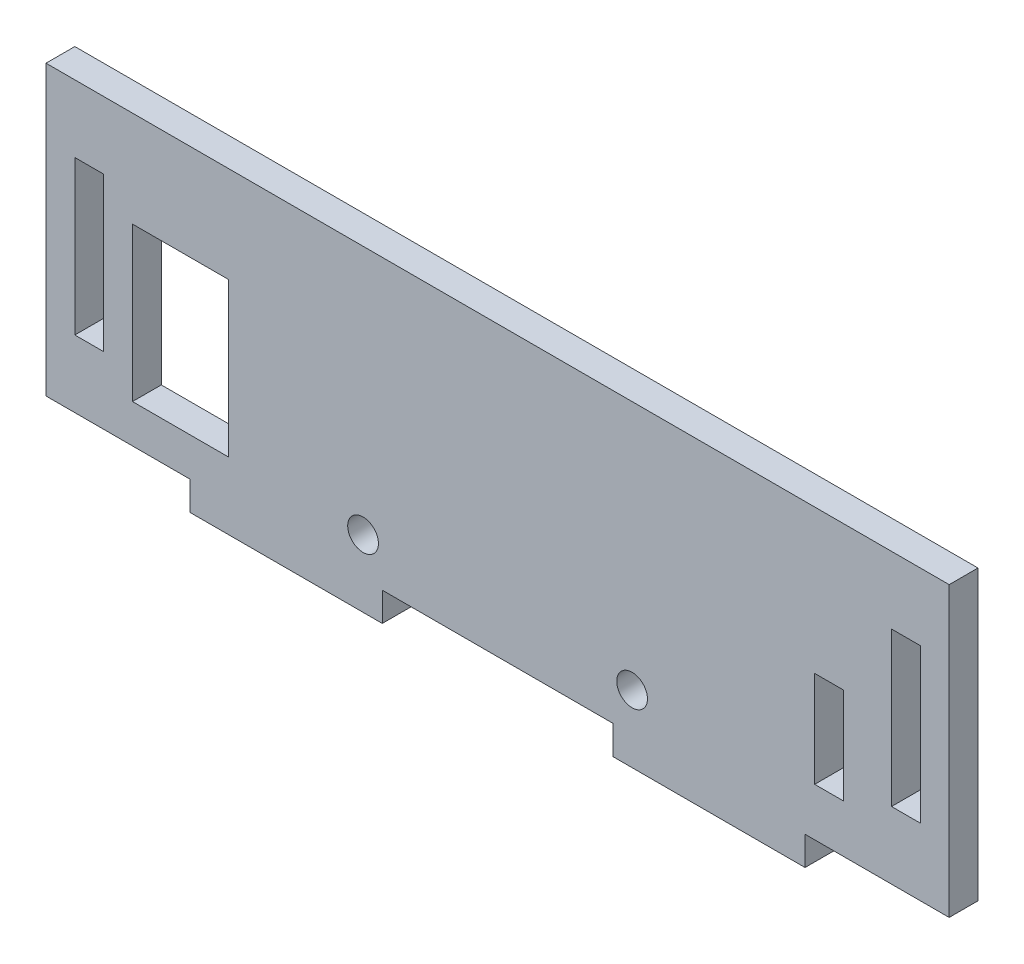
ISO-10303-21;
HEADER;
FILE_DESCRIPTION(('STEP AP214'),'2;1');
FILE_NAME('part.step','',(''),(''),'','','');
FILE_SCHEMA(('AUTOMOTIVE_DESIGN { 1 0 10303 214 1 1 1 1 }'));
ENDSEC;
DATA;
#1=APPLICATION_CONTEXT('core data for automotive mechanical design processes');
#2=APPLICATION_PROTOCOL_DEFINITION('international standard','automotive_design',2000,#1);
#3=PRODUCT_CONTEXT('',#1,'mechanical');
#4=PRODUCT('Part','Part','',(#3));
#5=PRODUCT_RELATED_PRODUCT_CATEGORY('part','',(#4));
#6=PRODUCT_DEFINITION_FORMATION('','',#4);
#7=PRODUCT_DEFINITION_CONTEXT('part definition',#1,'design');
#8=PRODUCT_DEFINITION('design','',#6,#7);
#9=PRODUCT_DEFINITION_SHAPE('','',#8);
#10=(LENGTH_UNIT() NAMED_UNIT(*) SI_UNIT(.MILLI.,.METRE.));
#11=(NAMED_UNIT(*) PLANE_ANGLE_UNIT() SI_UNIT($,.RADIAN.));
#12=(NAMED_UNIT(*) SI_UNIT($,.STERADIAN.) SOLID_ANGLE_UNIT());
#13=UNCERTAINTY_MEASURE_WITH_UNIT(LENGTH_MEASURE(1.E-05),#10,'distance_accuracy_value','');
#14=(GEOMETRIC_REPRESENTATION_CONTEXT(3) GLOBAL_UNCERTAINTY_ASSIGNED_CONTEXT((#13)) GLOBAL_UNIT_ASSIGNED_CONTEXT((#10,
#11,#12)) REPRESENTATION_CONTEXT('',''));
#15=CARTESIAN_POINT('',(0.,0.,0.));
#16=DIRECTION('',(0.,0.,1.));
#17=DIRECTION('',(1.,0.,0.));
#18=AXIS2_PLACEMENT_3D('',#15,#16,#17);
#19=CARTESIAN_POINT('',(0.,0.,3.));
#20=DIRECTION('',(-1.,0.,0.));
#21=DIRECTION('',(0.,0.,1.));
#22=AXIS2_PLACEMENT_3D('',#19,#20,#21);
#23=PLANE('',#22);
#24=DIRECTION('',(0.,1.,0.));
#25=VECTOR('',#24,1.);
#26=CARTESIAN_POINT('',(0.,0.,0.));
#27=LINE('',#26,#25);
#28=CARTESIAN_POINT('',(0.,7.,0.));
#29=VERTEX_POINT('',#28);
#30=CARTESIAN_POINT('',(0.,23.,0.));
#31=VERTEX_POINT('',#30);
#32=EDGE_CURVE('E329',#29,#31,#27,.T.);
#33=ORIENTED_EDGE('',*,*,#32,.T.);
#34=DIRECTION('',(0.,0.,-1.));
#35=VECTOR('',#34,1.);
#36=CARTESIAN_POINT('',(0.,23.,3.));
#37=LINE('',#36,#35);
#38=CARTESIAN_POINT('',(0.,23.,3.));
#39=VERTEX_POINT('',#38);
#40=EDGE_CURVE('E11',#39,#31,#37,.T.);
#41=ORIENTED_EDGE('',*,*,#40,.F.);
#42=DIRECTION('',(0.,1.,0.));
#43=VECTOR('',#42,1.);
#44=CARTESIAN_POINT('',(0.,0.,3.));
#45=LINE('',#44,#43);
#46=CARTESIAN_POINT('',(0.,7.,3.));
#47=VERTEX_POINT('',#46);
#48=EDGE_CURVE('E234',#47,#39,#45,.T.);
#49=ORIENTED_EDGE('',*,*,#48,.F.);
#50=DIRECTION('',(0.,0.,-1.));
#51=VECTOR('',#50,1.);
#52=CARTESIAN_POINT('',(0.,7.,3.));
#53=LINE('',#52,#51);
#54=EDGE_CURVE('E54',#47,#29,#53,.T.);
#55=ORIENTED_EDGE('',*,*,#54,.T.);
#56=EDGE_LOOP('',(#33,#41,#49,#55));
#57=FACE_BOUND('',#56,.T.);
#58=ADVANCED_FACE('F35',(#57),#23,.F.);
#59=CARTESIAN_POINT('',(0.,23.,3.));
#60=DIRECTION('',(0.,1.,0.));
#61=DIRECTION('',(0.,0.,1.));
#62=AXIS2_PLACEMENT_3D('',#59,#60,#61);
#63=PLANE('',#62);
#64=DIRECTION('',(1.,0.,0.));
#65=VECTOR('',#64,1.);
#66=CARTESIAN_POINT('',(0.,23.,0.));
#67=LINE('',#66,#65);
#68=CARTESIAN_POINT('',(3.,23.,0.));
#69=VERTEX_POINT('',#68);
#70=EDGE_CURVE('E240',#31,#69,#67,.T.);
#71=ORIENTED_EDGE('',*,*,#70,.T.);
#72=DIRECTION('',(0.,0.,-1.));
#73=VECTOR('',#72,1.);
#74=CARTESIAN_POINT('',(3.,23.,3.));
#75=LINE('',#74,#73);
#76=CARTESIAN_POINT('',(3.,23.,3.));
#77=VERTEX_POINT('',#76);
#78=EDGE_CURVE('E45',#77,#69,#75,.T.);
#79=ORIENTED_EDGE('',*,*,#78,.F.);
#80=DIRECTION('',(1.,0.,0.));
#81=VECTOR('',#80,1.);
#82=CARTESIAN_POINT('',(0.,23.,3.));
#83=LINE('',#82,#81);
#84=EDGE_CURVE('E228',#39,#77,#83,.T.);
#85=ORIENTED_EDGE('',*,*,#84,.F.);
#86=ORIENTED_EDGE('',*,*,#40,.T.);
#87=EDGE_LOOP('',(#71,#79,#85,#86));
#88=FACE_BOUND('',#87,.T.);
#89=ADVANCED_FACE('F239',(#88),#63,.F.);
#90=CARTESIAN_POINT('',(3.,0.,3.));
#91=DIRECTION('',(-1.,0.,0.));
#92=DIRECTION('',(0.,0.,1.));
#93=AXIS2_PLACEMENT_3D('',#90,#91,#92);
#94=PLANE('',#93);
#95=DIRECTION('',(0.,1.,0.));
#96=VECTOR('',#95,1.);
#97=CARTESIAN_POINT('',(3.,0.,0.));
#98=LINE('',#97,#96);
#99=CARTESIAN_POINT('',(3.,7.,0.));
#100=VERTEX_POINT('',#99);
#101=EDGE_CURVE('E332',#100,#69,#98,.T.);
#102=ORIENTED_EDGE('',*,*,#101,.F.);
#103=DIRECTION('',(0.,0.,-1.));
#104=VECTOR('',#103,1.);
#105=CARTESIAN_POINT('',(3.,7.,3.));
#106=LINE('',#105,#104);
#107=CARTESIAN_POINT('',(3.,7.,3.));
#108=VERTEX_POINT('',#107);
#109=EDGE_CURVE('E140',#108,#100,#106,.T.);
#110=ORIENTED_EDGE('',*,*,#109,.F.);
#111=DIRECTION('',(0.,1.,0.));
#112=VECTOR('',#111,1.);
#113=CARTESIAN_POINT('',(3.,0.,3.));
#114=LINE('',#113,#112);
#115=EDGE_CURVE('E233',#108,#77,#114,.T.);
#116=ORIENTED_EDGE('',*,*,#115,.T.);
#117=ORIENTED_EDGE('',*,*,#78,.T.);
#118=EDGE_LOOP('',(#102,#110,#116,#117));
#119=FACE_BOUND('',#118,.T.);
#120=ADVANCED_FACE('F244',(#119),#94,.T.);
#121=CARTESIAN_POINT('',(0.,4.,3.));
#122=DIRECTION('',(0.,1.,0.));
#123=DIRECTION('',(0.,0.,1.));
#124=AXIS2_PLACEMENT_3D('',#121,#122,#123);
#125=PLANE('',#124);
#126=DIRECTION('',(1.,0.,0.));
#127=VECTOR('',#126,1.);
#128=CARTESIAN_POINT('',(0.,4.,0.));
#129=LINE('',#128,#127);
#130=CARTESIAN_POINT('',(6.,4.,0.));
#131=VERTEX_POINT('',#130);
#132=CARTESIAN_POINT('',(16.,4.,0.));
#133=VERTEX_POINT('',#132);
#134=EDGE_CURVE('E314',#131,#133,#129,.T.);
#135=ORIENTED_EDGE('',*,*,#134,.F.);
#136=DIRECTION('',(0.,0.,-1.));
#137=VECTOR('',#136,1.);
#138=CARTESIAN_POINT('',(6.,4.,3.));
#139=LINE('',#138,#137);
#140=CARTESIAN_POINT('',(6.,4.,3.));
#141=VERTEX_POINT('',#140);
#142=EDGE_CURVE('E339',#141,#131,#139,.T.);
#143=ORIENTED_EDGE('',*,*,#142,.F.);
#144=DIRECTION('',(1.,0.,0.));
#145=VECTOR('',#144,1.);
#146=CARTESIAN_POINT('',(0.,4.,3.));
#147=LINE('',#146,#145);
#148=CARTESIAN_POINT('',(16.,4.,3.));
#149=VERTEX_POINT('',#148);
#150=EDGE_CURVE('E491',#141,#149,#147,.T.);
#151=ORIENTED_EDGE('',*,*,#150,.T.);
#152=DIRECTION('',(0.,0.,-1.));
#153=VECTOR('',#152,1.);
#154=CARTESIAN_POINT('',(16.,4.,3.));
#155=LINE('',#154,#153);
#156=EDGE_CURVE('E341',#149,#133,#155,.T.);
#157=ORIENTED_EDGE('',*,*,#156,.T.);
#158=EDGE_LOOP('',(#135,#143,#151,#157));
#159=FACE_BOUND('',#158,.T.);
#160=ADVANCED_FACE('F543',(#159),#125,.T.);
#161=CARTESIAN_POINT('',(6.,0.,3.));
#162=DIRECTION('',(-1.,0.,0.));
#163=DIRECTION('',(0.,0.,1.));
#164=AXIS2_PLACEMENT_3D('',#161,#162,#163);
#165=PLANE('',#164);
#166=DIRECTION('',(0.,1.,0.));
#167=VECTOR('',#166,1.);
#168=CARTESIAN_POINT('',(6.,0.,0.));
#169=LINE('',#168,#167);
#170=CARTESIAN_POINT('',(6.,20.,0.));
#171=VERTEX_POINT('',#170);
#172=EDGE_CURVE('E317',#131,#171,#169,.T.);
#173=ORIENTED_EDGE('',*,*,#172,.T.);
#174=DIRECTION('',(0.,0.,-1.));
#175=VECTOR('',#174,1.);
#176=CARTESIAN_POINT('',(6.,20.,3.));
#177=LINE('',#176,#175);
#178=CARTESIAN_POINT('',(6.,20.,3.));
#179=VERTEX_POINT('',#178);
#180=EDGE_CURVE('E346',#179,#171,#177,.T.);
#181=ORIENTED_EDGE('',*,*,#180,.F.);
#182=DIRECTION('',(0.,1.,0.));
#183=VECTOR('',#182,1.);
#184=CARTESIAN_POINT('',(6.,0.,3.));
#185=LINE('',#184,#183);
#186=EDGE_CURVE('E494',#141,#179,#185,.T.);
#187=ORIENTED_EDGE('',*,*,#186,.F.);
#188=ORIENTED_EDGE('',*,*,#142,.T.);
#189=EDGE_LOOP('',(#173,#181,#187,#188));
#190=FACE_BOUND('',#189,.T.);
#191=ADVANCED_FACE('F539',(#190),#165,.F.);
#192=CARTESIAN_POINT('',(0.,20.,3.));
#193=DIRECTION('',(0.,-1.,0.));
#194=DIRECTION('',(0.,0.,-1.));
#195=AXIS2_PLACEMENT_3D('',#192,#193,#194);
#196=PLANE('',#195);
#197=DIRECTION('',(-1.,0.,0.));
#198=VECTOR('',#197,1.);
#199=CARTESIAN_POINT('',(0.,20.,0.));
#200=LINE('',#199,#198);
#201=CARTESIAN_POINT('',(16.,20.,0.));
#202=VERTEX_POINT('',#201);
#203=EDGE_CURVE('E320',#202,#171,#200,.T.);
#204=ORIENTED_EDGE('',*,*,#203,.F.);
#205=DIRECTION('',(0.,0.,-1.));
#206=VECTOR('',#205,1.);
#207=CARTESIAN_POINT('',(16.,20.,3.));
#208=LINE('',#207,#206);
#209=CARTESIAN_POINT('',(16.,20.,3.));
#210=VERTEX_POINT('',#209);
#211=EDGE_CURVE('E343',#210,#202,#208,.T.);
#212=ORIENTED_EDGE('',*,*,#211,.F.);
#213=DIRECTION('',(-1.,0.,0.));
#214=VECTOR('',#213,1.);
#215=CARTESIAN_POINT('',(0.,20.,3.));
#216=LINE('',#215,#214);
#217=EDGE_CURVE('E496',#210,#179,#216,.T.);
#218=ORIENTED_EDGE('',*,*,#217,.T.);
#219=ORIENTED_EDGE('',*,*,#180,.T.);
#220=EDGE_LOOP('',(#204,#212,#218,#219));
#221=FACE_BOUND('',#220,.T.);
#222=ADVANCED_FACE('F535',(#221),#196,.T.);
#223=CARTESIAN_POINT('',(0.,23.,3.));
#224=DIRECTION('',(0.,-1.,0.));
#225=DIRECTION('',(0.,0.,-1.));
#226=AXIS2_PLACEMENT_3D('',#223,#224,#225);
#227=PLANE('',#226);
#228=DIRECTION('',(-1.,0.,0.));
#229=VECTOR('',#228,1.);
#230=CARTESIAN_POINT('',(0.,23.,0.));
#231=LINE('',#230,#229);
#232=CARTESIAN_POINT('',(88.,23.,0.));
#233=VERTEX_POINT('',#232);
#234=CARTESIAN_POINT('',(85.,23.,0.));
#235=VERTEX_POINT('',#234);
#236=EDGE_CURVE('E302',#233,#235,#231,.T.);
#237=ORIENTED_EDGE('',*,*,#236,.F.);
#238=DIRECTION('',(0.,0.,-1.));
#239=VECTOR('',#238,1.);
#240=CARTESIAN_POINT('',(88.,23.,3.));
#241=LINE('',#240,#239);
#242=CARTESIAN_POINT('',(88.,23.,3.));
#243=VERTEX_POINT('',#242);
#244=EDGE_CURVE('E344',#243,#233,#241,.T.);
#245=ORIENTED_EDGE('',*,*,#244,.F.);
#246=DIRECTION('',(-1.,0.,0.));
#247=VECTOR('',#246,1.);
#248=CARTESIAN_POINT('',(0.,23.,3.));
#249=LINE('',#248,#247);
#250=CARTESIAN_POINT('',(85.,23.,3.));
#251=VERTEX_POINT('',#250);
#252=EDGE_CURVE('E480',#243,#251,#249,.T.);
#253=ORIENTED_EDGE('',*,*,#252,.T.);
#254=DIRECTION('',(0.,0.,-1.));
#255=VECTOR('',#254,1.);
#256=CARTESIAN_POINT('',(85.,23.,3.));
#257=LINE('',#256,#255);
#258=EDGE_CURVE('E349',#251,#235,#257,.T.);
#259=ORIENTED_EDGE('',*,*,#258,.T.);
#260=EDGE_LOOP('',(#237,#245,#253,#259));
#261=FACE_BOUND('',#260,.T.);
#262=ADVANCED_FACE('F538',(#261),#227,.T.);
#263=CARTESIAN_POINT('',(88.,0.,3.));
#264=DIRECTION('',(-1.,0.,0.));
#265=DIRECTION('',(0.,0.,1.));
#266=AXIS2_PLACEMENT_3D('',#263,#264,#265);
#267=PLANE('',#266);
#268=DIRECTION('',(0.,1.,0.));
#269=VECTOR('',#268,1.);
#270=CARTESIAN_POINT('',(88.,0.,0.));
#271=LINE('',#270,#269);
#272=CARTESIAN_POINT('',(88.,7.,0.));
#273=VERTEX_POINT('',#272);
#274=EDGE_CURVE('E305',#273,#233,#271,.T.);
#275=ORIENTED_EDGE('',*,*,#274,.F.);
#276=DIRECTION('',(0.,0.,-1.));
#277=VECTOR('',#276,1.);
#278=CARTESIAN_POINT('',(88.,7.,3.));
#279=LINE('',#278,#277);
#280=CARTESIAN_POINT('',(88.,7.,3.));
#281=VERTEX_POINT('',#280);
#282=EDGE_CURVE('E354',#281,#273,#279,.T.);
#283=ORIENTED_EDGE('',*,*,#282,.F.);
#284=DIRECTION('',(0.,1.,0.));
#285=VECTOR('',#284,1.);
#286=CARTESIAN_POINT('',(88.,0.,3.));
#287=LINE('',#286,#285);
#288=EDGE_CURVE('E483',#281,#243,#287,.T.);
#289=ORIENTED_EDGE('',*,*,#288,.T.);
#290=ORIENTED_EDGE('',*,*,#244,.T.);
#291=EDGE_LOOP('',(#275,#283,#289,#290));
#292=FACE_BOUND('',#291,.T.);
#293=ADVANCED_FACE('F556',(#292),#267,.T.);
#294=CARTESIAN_POINT('',(0.,7.,3.));
#295=DIRECTION('',(0.,-1.,0.));
#296=DIRECTION('',(0.,0.,-1.));
#297=AXIS2_PLACEMENT_3D('',#294,#295,#296);
#298=PLANE('',#297);
#299=DIRECTION('',(-1.,0.,0.));
#300=VECTOR('',#299,1.);
#301=CARTESIAN_POINT('',(0.,7.,0.));
#302=LINE('',#301,#300);
#303=CARTESIAN_POINT('',(85.,7.,0.));
#304=VERTEX_POINT('',#303);
#305=EDGE_CURVE('E308',#273,#304,#302,.T.);
#306=ORIENTED_EDGE('',*,*,#305,.T.);
#307=DIRECTION('',(0.,0.,-1.));
#308=VECTOR('',#307,1.);
#309=CARTESIAN_POINT('',(85.,7.,3.));
#310=LINE('',#309,#308);
#311=CARTESIAN_POINT('',(85.,7.,3.));
#312=VERTEX_POINT('',#311);
#313=EDGE_CURVE('E351',#312,#304,#310,.T.);
#314=ORIENTED_EDGE('',*,*,#313,.F.);
#315=DIRECTION('',(-1.,0.,0.));
#316=VECTOR('',#315,1.);
#317=CARTESIAN_POINT('',(0.,7.,3.));
#318=LINE('',#317,#316);
#319=EDGE_CURVE('E486',#281,#312,#318,.T.);
#320=ORIENTED_EDGE('',*,*,#319,.F.);
#321=ORIENTED_EDGE('',*,*,#282,.T.);
#322=EDGE_LOOP('',(#306,#314,#320,#321));
#323=FACE_BOUND('',#322,.T.);
#324=ADVANCED_FACE('F552',(#323),#298,.F.);
#325=CARTESIAN_POINT('',(0.,15.,3.));
#326=DIRECTION('',(0.,-1.,0.));
#327=DIRECTION('',(0.,0.,-1.));
#328=AXIS2_PLACEMENT_3D('',#325,#326,#327);
#329=PLANE('',#328);
#330=DIRECTION('',(-1.,0.,0.));
#331=VECTOR('',#330,1.);
#332=CARTESIAN_POINT('',(0.,15.,0.));
#333=LINE('',#332,#331);
#334=CARTESIAN_POINT('',(80.,15.,0.));
#335=VERTEX_POINT('',#334);
#336=CARTESIAN_POINT('',(77.,15.,0.));
#337=VERTEX_POINT('',#336);
#338=EDGE_CURVE('E290',#335,#337,#333,.T.);
#339=ORIENTED_EDGE('',*,*,#338,.F.);
#340=DIRECTION('',(0.,0.,-1.));
#341=VECTOR('',#340,1.);
#342=CARTESIAN_POINT('',(80.,15.,3.));
#343=LINE('',#342,#341);
#344=CARTESIAN_POINT('',(80.,15.,3.));
#345=VERTEX_POINT('',#344);
#346=EDGE_CURVE('E352',#345,#335,#343,.T.);
#347=ORIENTED_EDGE('',*,*,#346,.F.);
#348=DIRECTION('',(-1.,0.,0.));
#349=VECTOR('',#348,1.);
#350=CARTESIAN_POINT('',(0.,15.,3.));
#351=LINE('',#350,#349);
#352=CARTESIAN_POINT('',(77.,15.,3.));
#353=VERTEX_POINT('',#352);
#354=EDGE_CURVE('E469',#345,#353,#351,.T.);
#355=ORIENTED_EDGE('',*,*,#354,.T.);
#356=DIRECTION('',(0.,0.,-1.));
#357=VECTOR('',#356,1.);
#358=CARTESIAN_POINT('',(77.,15.,3.));
#359=LINE('',#358,#357);
#360=EDGE_CURVE('E357',#353,#337,#359,.T.);
#361=ORIENTED_EDGE('',*,*,#360,.T.);
#362=EDGE_LOOP('',(#339,#347,#355,#361));
#363=FACE_BOUND('',#362,.T.);
#364=ADVANCED_FACE('F555',(#363),#329,.T.);
#365=CARTESIAN_POINT('',(80.,0.,3.));
#366=DIRECTION('',(1.,0.,0.));
#367=DIRECTION('',(0.,0.,-1.));
#368=AXIS2_PLACEMENT_3D('',#365,#366,#367);
#369=PLANE('',#368);
#370=DIRECTION('',(0.,-1.,0.));
#371=VECTOR('',#370,1.);
#372=CARTESIAN_POINT('',(80.,0.,0.));
#373=LINE('',#372,#371);
#374=CARTESIAN_POINT('',(80.,5.,0.));
#375=VERTEX_POINT('',#374);
#376=EDGE_CURVE('E293',#335,#375,#373,.T.);
#377=ORIENTED_EDGE('',*,*,#376,.T.);
#378=DIRECTION('',(0.,0.,-1.));
#379=VECTOR('',#378,1.);
#380=CARTESIAN_POINT('',(80.,5.,3.));
#381=LINE('',#380,#379);
#382=CARTESIAN_POINT('',(80.,5.,3.));
#383=VERTEX_POINT('',#382);
#384=EDGE_CURVE('E361',#383,#375,#381,.T.);
#385=ORIENTED_EDGE('',*,*,#384,.F.);
#386=DIRECTION('',(0.,-1.,0.));
#387=VECTOR('',#386,1.);
#388=CARTESIAN_POINT('',(80.,0.,3.));
#389=LINE('',#388,#387);
#390=EDGE_CURVE('E472',#345,#383,#389,.T.);
#391=ORIENTED_EDGE('',*,*,#390,.F.);
#392=ORIENTED_EDGE('',*,*,#346,.T.);
#393=EDGE_LOOP('',(#377,#385,#391,#392));
#394=FACE_BOUND('',#393,.T.);
#395=ADVANCED_FACE('F570',(#394),#369,.F.);
#396=CARTESIAN_POINT('',(0.,5.,3.));
#397=DIRECTION('',(0.,-1.,0.));
#398=DIRECTION('',(0.,0.,-1.));
#399=AXIS2_PLACEMENT_3D('',#396,#397,#398);
#400=PLANE('',#399);
#401=DIRECTION('',(-1.,0.,0.));
#402=VECTOR('',#401,1.);
#403=CARTESIAN_POINT('',(0.,5.,0.));
#404=LINE('',#403,#402);
#405=CARTESIAN_POINT('',(77.,5.,0.));
#406=VERTEX_POINT('',#405);
#407=EDGE_CURVE('E296',#375,#406,#404,.T.);
#408=ORIENTED_EDGE('',*,*,#407,.T.);
#409=DIRECTION('',(0.,0.,-1.));
#410=VECTOR('',#409,1.);
#411=CARTESIAN_POINT('',(77.,5.,3.));
#412=LINE('',#411,#410);
#413=CARTESIAN_POINT('',(77.,5.,3.));
#414=VERTEX_POINT('',#413);
#415=EDGE_CURVE('E359',#414,#406,#412,.T.);
#416=ORIENTED_EDGE('',*,*,#415,.F.);
#417=DIRECTION('',(-1.,0.,0.));
#418=VECTOR('',#417,1.);
#419=CARTESIAN_POINT('',(0.,5.,3.));
#420=LINE('',#419,#418);
#421=EDGE_CURVE('E475',#383,#414,#420,.T.);
#422=ORIENTED_EDGE('',*,*,#421,.F.);
#423=ORIENTED_EDGE('',*,*,#384,.T.);
#424=EDGE_LOOP('',(#408,#416,#422,#423));
#425=FACE_BOUND('',#424,.T.);
#426=ADVANCED_FACE('F567',(#425),#400,.F.);
#427=CARTESIAN_POINT('',(0.,30.,3.));
#428=DIRECTION('',(0.,1.,0.));
#429=DIRECTION('',(0.,0.,1.));
#430=AXIS2_PLACEMENT_3D('',#427,#428,#429);
#431=PLANE('',#430);
#432=DIRECTION('',(1.,0.,0.));
#433=VECTOR('',#432,1.);
#434=CARTESIAN_POINT('',(0.,30.,0.));
#435=LINE('',#434,#433);
#436=CARTESIAN_POINT('',(-3.,30.,0.));
#437=VERTEX_POINT('',#436);
#438=CARTESIAN_POINT('',(91.,30.,0.));
#439=VERTEX_POINT('',#438);
#440=EDGE_CURVE('E254',#437,#439,#435,.T.);
#441=ORIENTED_EDGE('',*,*,#440,.F.);
#442=DIRECTION('',(0.,0.,-1.));
#443=VECTOR('',#442,1.);
#444=CARTESIAN_POINT('',(-3.,30.,3.));
#445=LINE('',#444,#443);
#446=CARTESIAN_POINT('',(-3.,30.,3.));
#447=VERTEX_POINT('',#446);
#448=EDGE_CURVE('E39',#447,#437,#445,.T.);
#449=ORIENTED_EDGE('',*,*,#448,.F.);
#450=DIRECTION('',(1.,0.,0.));
#451=VECTOR('',#450,1.);
#452=CARTESIAN_POINT('',(0.,30.,3.));
#453=LINE('',#452,#451);
#454=CARTESIAN_POINT('',(91.,30.,3.));
#455=VERTEX_POINT('',#454);
#456=EDGE_CURVE('E402',#447,#455,#453,.T.);
#457=ORIENTED_EDGE('',*,*,#456,.T.);
#458=DIRECTION('',(0.,0.,-1.));
#459=VECTOR('',#458,1.);
#460=CARTESIAN_POINT('',(91.,30.,3.));
#461=LINE('',#460,#459);
#462=EDGE_CURVE('E247',#455,#439,#461,.T.);
#463=ORIENTED_EDGE('',*,*,#462,.T.);
#464=EDGE_LOOP('',(#441,#449,#457,#463));
#465=FACE_BOUND('',#464,.T.);
#466=ADVANCED_FACE('F401',(#465),#431,.T.);
#467=CARTESIAN_POINT('',(-3.,0.,3.));
#468=DIRECTION('',(1.,0.,0.));
#469=DIRECTION('',(0.,0.,-1.));
#470=AXIS2_PLACEMENT_3D('',#467,#468,#469);
#471=PLANE('',#470);
#472=DIRECTION('',(0.,-1.,0.));
#473=VECTOR('',#472,1.);
#474=CARTESIAN_POINT('',(-3.,0.,0.));
#475=LINE('',#474,#473);
#476=CARTESIAN_POINT('',(-3.,0.,0.));
#477=VERTEX_POINT('',#476);
#478=EDGE_CURVE('E257',#437,#477,#475,.T.);
#479=ORIENTED_EDGE('',*,*,#478,.T.);
#480=DIRECTION('',(0.,0.,-1.));
#481=VECTOR('',#480,1.);
#482=CARTESIAN_POINT('',(-3.,0.,3.));
#483=LINE('',#482,#481);
#484=CARTESIAN_POINT('',(-3.,0.,3.));
#485=VERTEX_POINT('',#484);
#486=EDGE_CURVE('E386',#485,#477,#483,.T.);
#487=ORIENTED_EDGE('',*,*,#486,.F.);
#488=DIRECTION('',(0.,-1.,0.));
#489=VECTOR('',#488,1.);
#490=CARTESIAN_POINT('',(-3.,0.,3.));
#491=LINE('',#490,#489);
#492=EDGE_CURVE('E394',#447,#485,#491,.T.);
#493=ORIENTED_EDGE('',*,*,#492,.F.);
#494=ORIENTED_EDGE('',*,*,#448,.T.);
#495=EDGE_LOOP('',(#479,#487,#493,#494));
#496=FACE_BOUND('',#495,.T.);
#497=ADVANCED_FACE('F393',(#496),#471,.F.);
#498=CARTESIAN_POINT('',(0.,0.,3.));
#499=DIRECTION('',(0.,-1.,0.));
#500=DIRECTION('',(0.,0.,-1.));
#501=AXIS2_PLACEMENT_3D('',#498,#499,#500);
#502=PLANE('',#501);
#503=DIRECTION('',(-1.,0.,0.));
#504=VECTOR('',#503,1.);
#505=CARTESIAN_POINT('',(0.,0.,0.));
#506=LINE('',#505,#504);
#507=CARTESIAN_POINT('',(12.,0.,0.));
#508=VERTEX_POINT('',#507);
#509=EDGE_CURVE('E260',#508,#477,#506,.T.);
#510=ORIENTED_EDGE('',*,*,#509,.F.);
#511=DIRECTION('',(0.,0.,-1.));
#512=VECTOR('',#511,1.);
#513=CARTESIAN_POINT('',(12.,0.,3.));
#514=LINE('',#513,#512);
#515=CARTESIAN_POINT('',(12.,0.,3.));
#516=VERTEX_POINT('',#515);
#517=EDGE_CURVE('E385',#516,#508,#514,.T.);
#518=ORIENTED_EDGE('',*,*,#517,.F.);
#519=DIRECTION('',(-1.,0.,0.));
#520=VECTOR('',#519,1.);
#521=CARTESIAN_POINT('',(0.,0.,3.));
#522=LINE('',#521,#520);
#523=EDGE_CURVE('E452',#516,#485,#522,.T.);
#524=ORIENTED_EDGE('',*,*,#523,.T.);
#525=ORIENTED_EDGE('',*,*,#486,.T.);
#526=EDGE_LOOP('',(#510,#518,#524,#525));
#527=FACE_BOUND('',#526,.T.);
#528=ADVANCED_FACE('F451',(#527),#502,.T.);
#529=CARTESIAN_POINT('',(12.,0.,3.));
#530=DIRECTION('',(1.,0.,0.));
#531=DIRECTION('',(0.,0.,-1.));
#532=AXIS2_PLACEMENT_3D('',#529,#530,#531);
#533=PLANE('',#532);
#534=DIRECTION('',(0.,-1.,0.));
#535=VECTOR('',#534,1.);
#536=CARTESIAN_POINT('',(12.,0.,0.));
#537=LINE('',#536,#535);
#538=CARTESIAN_POINT('',(12.,-3.,0.));
#539=VERTEX_POINT('',#538);
#540=EDGE_CURVE('E263',#508,#539,#537,.T.);
#541=ORIENTED_EDGE('',*,*,#540,.T.);
#542=DIRECTION('',(0.,0.,-1.));
#543=VECTOR('',#542,1.);
#544=CARTESIAN_POINT('',(12.,-3.,3.));
#545=LINE('',#544,#543);
#546=CARTESIAN_POINT('',(12.,-3.,3.));
#547=VERTEX_POINT('',#546);
#548=EDGE_CURVE('E382',#547,#539,#545,.T.);
#549=ORIENTED_EDGE('',*,*,#548,.F.);
#550=DIRECTION('',(0.,-1.,0.));
#551=VECTOR('',#550,1.);
#552=CARTESIAN_POINT('',(12.,0.,3.));
#553=LINE('',#552,#551);
#554=EDGE_CURVE('E449',#516,#547,#553,.T.);
#555=ORIENTED_EDGE('',*,*,#554,.F.);
#556=ORIENTED_EDGE('',*,*,#517,.T.);
#557=EDGE_LOOP('',(#541,#549,#555,#556));
#558=FACE_BOUND('',#557,.T.);
#559=ADVANCED_FACE('F448',(#558),#533,.F.);
#560=CARTESIAN_POINT('',(0.,-3.,3.));
#561=DIRECTION('',(0.,1.,0.));
#562=DIRECTION('',(0.,0.,1.));
#563=AXIS2_PLACEMENT_3D('',#560,#561,#562);
#564=PLANE('',#563);
#565=DIRECTION('',(1.,0.,0.));
#566=VECTOR('',#565,1.);
#567=CARTESIAN_POINT('',(0.,-3.,0.));
#568=LINE('',#567,#566);
#569=CARTESIAN_POINT('',(32.,-3.,0.));
#570=VERTEX_POINT('',#569);
#571=EDGE_CURVE('E266',#539,#570,#568,.T.);
#572=ORIENTED_EDGE('',*,*,#571,.T.);
#573=DIRECTION('',(0.,0.,-1.));
#574=VECTOR('',#573,1.);
#575=CARTESIAN_POINT('',(32.,-3.,3.));
#576=LINE('',#575,#574);
#577=CARTESIAN_POINT('',(32.,-3.,3.));
#578=VERTEX_POINT('',#577);
#579=EDGE_CURVE('E379',#578,#570,#576,.T.);
#580=ORIENTED_EDGE('',*,*,#579,.F.);
#581=DIRECTION('',(1.,0.,0.));
#582=VECTOR('',#581,1.);
#583=CARTESIAN_POINT('',(0.,-3.,3.));
#584=LINE('',#583,#582);
#585=EDGE_CURVE('E444',#547,#578,#584,.T.);
#586=ORIENTED_EDGE('',*,*,#585,.F.);
#587=ORIENTED_EDGE('',*,*,#548,.T.);
#588=EDGE_LOOP('',(#572,#580,#586,#587));
#589=FACE_BOUND('',#588,.T.);
#590=ADVANCED_FACE('F442',(#589),#564,.F.);
#591=CARTESIAN_POINT('',(32.,0.,3.));
#592=DIRECTION('',(-1.,0.,0.));
#593=DIRECTION('',(0.,0.,1.));
#594=AXIS2_PLACEMENT_3D('',#591,#592,#593);
#595=PLANE('',#594);
#596=DIRECTION('',(0.,1.,0.));
#597=VECTOR('',#596,1.);
#598=CARTESIAN_POINT('',(32.,0.,0.));
#599=LINE('',#598,#597);
#600=CARTESIAN_POINT('',(32.,0.,0.));
#601=VERTEX_POINT('',#600);
#602=EDGE_CURVE('E269',#570,#601,#599,.T.);
#603=ORIENTED_EDGE('',*,*,#602,.T.);
#604=DIRECTION('',(0.,0.,-1.));
#605=VECTOR('',#604,1.);
#606=CARTESIAN_POINT('',(32.,0.,3.));
#607=LINE('',#606,#605);
#608=CARTESIAN_POINT('',(32.,0.,3.));
#609=VERTEX_POINT('',#608);
#610=EDGE_CURVE('E376',#609,#601,#607,.T.);
#611=ORIENTED_EDGE('',*,*,#610,.F.);
#612=DIRECTION('',(0.,1.,0.));
#613=VECTOR('',#612,1.);
#614=CARTESIAN_POINT('',(32.,0.,3.));
#615=LINE('',#614,#613);
#616=EDGE_CURVE('E460',#578,#609,#615,.T.);
#617=ORIENTED_EDGE('',*,*,#616,.F.);
#618=ORIENTED_EDGE('',*,*,#579,.T.);
#619=EDGE_LOOP('',(#603,#611,#617,#618));
#620=FACE_BOUND('',#619,.T.);
#621=ADVANCED_FACE('F438',(#620),#595,.F.);
#622=CARTESIAN_POINT('',(0.,0.,3.));
#623=DIRECTION('',(0.,1.,0.));
#624=DIRECTION('',(0.,0.,1.));
#625=AXIS2_PLACEMENT_3D('',#622,#623,#624);
#626=PLANE('',#625);
#627=DIRECTION('',(1.,0.,0.));
#628=VECTOR('',#627,1.);
#629=CARTESIAN_POINT('',(0.,0.,0.));
#630=LINE('',#629,#628);
#631=CARTESIAN_POINT('',(56.,0.,0.));
#632=VERTEX_POINT('',#631);
#633=EDGE_CURVE('E272',#601,#632,#630,.T.);
#634=ORIENTED_EDGE('',*,*,#633,.T.);
#635=DIRECTION('',(0.,0.,-1.));
#636=VECTOR('',#635,1.);
#637=CARTESIAN_POINT('',(56.,0.,3.));
#638=LINE('',#637,#636);
#639=CARTESIAN_POINT('',(56.,0.,3.));
#640=VERTEX_POINT('',#639);
#641=EDGE_CURVE('E374',#640,#632,#638,.T.);
#642=ORIENTED_EDGE('',*,*,#641,.F.);
#643=DIRECTION('',(1.,0.,0.));
#644=VECTOR('',#643,1.);
#645=CARTESIAN_POINT('',(0.,0.,3.));
#646=LINE('',#645,#644);
#647=EDGE_CURVE('E435',#609,#640,#646,.T.);
#648=ORIENTED_EDGE('',*,*,#647,.F.);
#649=ORIENTED_EDGE('',*,*,#610,.T.);
#650=EDGE_LOOP('',(#634,#642,#648,#649));
#651=FACE_BOUND('',#650,.T.);
#652=ADVANCED_FACE('F433',(#651),#626,.F.);
#653=CARTESIAN_POINT('',(56.,0.,3.));
#654=DIRECTION('',(-1.,0.,0.));
#655=DIRECTION('',(0.,0.,1.));
#656=AXIS2_PLACEMENT_3D('',#653,#654,#655);
#657=PLANE('',#656);
#658=DIRECTION('',(0.,1.,0.));
#659=VECTOR('',#658,1.);
#660=CARTESIAN_POINT('',(56.,0.,0.));
#661=LINE('',#660,#659);
#662=CARTESIAN_POINT('',(56.,-3.,0.));
#663=VERTEX_POINT('',#662);
#664=EDGE_CURVE('E275',#663,#632,#661,.T.);
#665=ORIENTED_EDGE('',*,*,#664,.F.);
#666=DIRECTION('',(0.,0.,-1.));
#667=VECTOR('',#666,1.);
#668=CARTESIAN_POINT('',(56.,-3.,3.));
#669=LINE('',#668,#667);
#670=CARTESIAN_POINT('',(56.,-3.,3.));
#671=VERTEX_POINT('',#670);
#672=EDGE_CURVE('E372',#671,#663,#669,.T.);
#673=ORIENTED_EDGE('',*,*,#672,.F.);
#674=DIRECTION('',(0.,1.,0.));
#675=VECTOR('',#674,1.);
#676=CARTESIAN_POINT('',(56.,0.,3.));
#677=LINE('',#676,#675);
#678=EDGE_CURVE('E431',#671,#640,#677,.T.);
#679=ORIENTED_EDGE('',*,*,#678,.T.);
#680=ORIENTED_EDGE('',*,*,#641,.T.);
#681=EDGE_LOOP('',(#665,#673,#679,#680));
#682=FACE_BOUND('',#681,.T.);
#683=ADVANCED_FACE('F427',(#682),#657,.T.);
#684=CARTESIAN_POINT('',(0.,-3.00000000000001,3.));
#685=DIRECTION('',(0.,-1.,0.));
#686=DIRECTION('',(1.,0.,0.));
#687=AXIS2_PLACEMENT_3D('',#684,#685,#686);
#688=PLANE('',#687);
#689=DIRECTION('',(-1.,0.,0.));
#690=VECTOR('',#689,1.);
#691=CARTESIAN_POINT('',(0.,-3.00000000000001,0.));
#692=LINE('',#691,#690);
#693=CARTESIAN_POINT('',(76.,-3.,0.));
#694=VERTEX_POINT('',#693);
#695=EDGE_CURVE('E278',#694,#663,#692,.T.);
#696=ORIENTED_EDGE('',*,*,#695,.F.);
#697=DIRECTION('',(0.,0.,-1.));
#698=VECTOR('',#697,1.);
#699=CARTESIAN_POINT('',(76.,-3.,3.));
#700=LINE('',#699,#698);
#701=CARTESIAN_POINT('',(76.,-3.,3.));
#702=VERTEX_POINT('',#701);
#703=EDGE_CURVE('E370',#702,#694,#700,.T.);
#704=ORIENTED_EDGE('',*,*,#703,.F.);
#705=DIRECTION('',(-1.,0.,0.));
#706=VECTOR('',#705,1.);
#707=CARTESIAN_POINT('',(0.,-3.00000000000001,3.));
#708=LINE('',#707,#706);
#709=EDGE_CURVE('E464',#702,#671,#708,.T.);
#710=ORIENTED_EDGE('',*,*,#709,.T.);
#711=ORIENTED_EDGE('',*,*,#672,.T.);
#712=EDGE_LOOP('',(#696,#704,#710,#711));
#713=FACE_BOUND('',#712,.T.);
#714=ADVANCED_FACE('F424',(#713),#688,.T.);
#715=CARTESIAN_POINT('',(76.,0.,3.));
#716=DIRECTION('',(1.,0.,0.));
#717=DIRECTION('',(0.,0.,-1.));
#718=AXIS2_PLACEMENT_3D('',#715,#716,#717);
#719=PLANE('',#718);
#720=DIRECTION('',(0.,-1.,0.));
#721=VECTOR('',#720,1.);
#722=CARTESIAN_POINT('',(76.,0.,0.));
#723=LINE('',#722,#721);
#724=CARTESIAN_POINT('',(76.,0.,0.));
#725=VERTEX_POINT('',#724);
#726=EDGE_CURVE('E281',#725,#694,#723,.T.);
#727=ORIENTED_EDGE('',*,*,#726,.F.);
#728=DIRECTION('',(0.,0.,-1.));
#729=VECTOR('',#728,1.);
#730=CARTESIAN_POINT('',(76.,0.,3.));
#731=LINE('',#730,#729);
#732=CARTESIAN_POINT('',(76.,0.,3.));
#733=VERTEX_POINT('',#732);
#734=EDGE_CURVE('E368',#733,#725,#731,.T.);
#735=ORIENTED_EDGE('',*,*,#734,.F.);
#736=DIRECTION('',(0.,-1.,0.));
#737=VECTOR('',#736,1.);
#738=CARTESIAN_POINT('',(76.,0.,3.));
#739=LINE('',#738,#737);
#740=EDGE_CURVE('E420',#733,#702,#739,.T.);
#741=ORIENTED_EDGE('',*,*,#740,.T.);
#742=ORIENTED_EDGE('',*,*,#703,.T.);
#743=EDGE_LOOP('',(#727,#735,#741,#742));
#744=FACE_BOUND('',#743,.T.);
#745=ADVANCED_FACE('F418',(#744),#719,.T.);
#746=CARTESIAN_POINT('',(0.,0.,3.));
#747=DIRECTION('',(0.,-1.,0.));
#748=DIRECTION('',(0.,0.,-1.));
#749=AXIS2_PLACEMENT_3D('',#746,#747,#748);
#750=PLANE('',#749);
#751=DIRECTION('',(-1.,0.,0.));
#752=VECTOR('',#751,1.);
#753=CARTESIAN_POINT('',(0.,0.,0.));
#754=LINE('',#753,#752);
#755=CARTESIAN_POINT('',(91.,0.,0.));
#756=VERTEX_POINT('',#755);
#757=EDGE_CURVE('E284',#756,#725,#754,.T.);
#758=ORIENTED_EDGE('',*,*,#757,.F.);
#759=DIRECTION('',(0.,0.,-1.));
#760=VECTOR('',#759,1.);
#761=CARTESIAN_POINT('',(91.,0.,3.));
#762=LINE('',#761,#760);
#763=CARTESIAN_POINT('',(91.,0.,3.));
#764=VERTEX_POINT('',#763);
#765=EDGE_CURVE('E366',#764,#756,#762,.T.);
#766=ORIENTED_EDGE('',*,*,#765,.F.);
#767=DIRECTION('',(-1.,0.,0.));
#768=VECTOR('',#767,1.);
#769=CARTESIAN_POINT('',(0.,0.,3.));
#770=LINE('',#769,#768);
#771=EDGE_CURVE('E414',#764,#733,#770,.T.);
#772=ORIENTED_EDGE('',*,*,#771,.T.);
#773=ORIENTED_EDGE('',*,*,#734,.T.);
#774=EDGE_LOOP('',(#758,#766,#772,#773));
#775=FACE_BOUND('',#774,.T.);
#776=ADVANCED_FACE('F411',(#775),#750,.T.);
#777=CARTESIAN_POINT('',(30.,4.,3.));
#778=DIRECTION('',(0.,0.,-1.));
#779=DIRECTION('',(-1.,0.,0.));
#780=AXIS2_PLACEMENT_3D('',#777,#778,#779);
#781=CYLINDRICAL_SURFACE('',#780,1.6);
#782=CARTESIAN_POINT('',(30.,4.,3.));
#783=DIRECTION('',(0.,0.,1.));
#784=DIRECTION('',(1.,0.,0.));
#785=AXIS2_PLACEMENT_3D('',#782,#783,#784);
#786=CIRCLE('',#785,1.6);
#787=CARTESIAN_POINT('',(31.6,4.,3.));
#788=VERTEX_POINT('',#787);
#789=EDGE_CURVE('E501',#788,#788,#786,.T.);
#790=ORIENTED_EDGE('',*,*,#789,.T.);
#791=EDGE_LOOP('',(#790));
#792=FACE_BOUND('',#791,.T.);
#793=CARTESIAN_POINT('',(30.,4.,0.));
#794=DIRECTION('',(0.,0.,1.));
#795=DIRECTION('',(1.,0.,0.));
#796=AXIS2_PLACEMENT_3D('',#793,#794,#795);
#797=CIRCLE('',#796,1.6);
#798=CARTESIAN_POINT('',(31.6,4.,0.));
#799=VERTEX_POINT('',#798);
#800=EDGE_CURVE('E326',#799,#799,#797,.T.);
#801=ORIENTED_EDGE('',*,*,#800,.F.);
#802=EDGE_LOOP('',(#801));
#803=FACE_BOUND('',#802,.T.);
#804=ADVANCED_FACE('F505',(#792,#803),#781,.F.);
#805=CARTESIAN_POINT('',(16.,0.,3.));
#806=DIRECTION('',(1.,0.,0.));
#807=DIRECTION('',(0.,0.,-1.));
#808=AXIS2_PLACEMENT_3D('',#805,#806,#807);
#809=PLANE('',#808);
#810=DIRECTION('',(0.,-1.,0.));
#811=VECTOR('',#810,1.);
#812=CARTESIAN_POINT('',(16.,0.,0.));
#813=LINE('',#812,#811);
#814=EDGE_CURVE('E323',#202,#133,#813,.T.);
#815=ORIENTED_EDGE('',*,*,#814,.T.);
#816=ORIENTED_EDGE('',*,*,#156,.F.);
#817=DIRECTION('',(0.,-1.,0.));
#818=VECTOR('',#817,1.);
#819=CARTESIAN_POINT('',(16.,0.,3.));
#820=LINE('',#819,#818);
#821=EDGE_CURVE('E499',#210,#149,#820,.T.);
#822=ORIENTED_EDGE('',*,*,#821,.F.);
#823=ORIENTED_EDGE('',*,*,#211,.T.);
#824=EDGE_LOOP('',(#815,#816,#822,#823));
#825=FACE_BOUND('',#824,.T.);
#826=ADVANCED_FACE('F530',(#825),#809,.F.);
#827=CARTESIAN_POINT('',(85.,0.,3.));
#828=DIRECTION('',(1.,0.,0.));
#829=DIRECTION('',(0.,0.,-1.));
#830=AXIS2_PLACEMENT_3D('',#827,#828,#829);
#831=PLANE('',#830);
#832=DIRECTION('',(0.,-1.,0.));
#833=VECTOR('',#832,1.);
#834=CARTESIAN_POINT('',(85.,0.,0.));
#835=LINE('',#834,#833);
#836=EDGE_CURVE('E311',#235,#304,#835,.T.);
#837=ORIENTED_EDGE('',*,*,#836,.F.);
#838=ORIENTED_EDGE('',*,*,#258,.F.);
#839=DIRECTION('',(0.,-1.,0.));
#840=VECTOR('',#839,1.);
#841=CARTESIAN_POINT('',(85.,0.,3.));
#842=LINE('',#841,#840);
#843=EDGE_CURVE('E488',#251,#312,#842,.T.);
#844=ORIENTED_EDGE('',*,*,#843,.T.);
#845=ORIENTED_EDGE('',*,*,#313,.T.);
#846=EDGE_LOOP('',(#837,#838,#844,#845));
#847=FACE_BOUND('',#846,.T.);
#848=ADVANCED_FACE('F533',(#847),#831,.T.);
#849=CARTESIAN_POINT('',(77.,0.,3.));
#850=DIRECTION('',(1.,0.,0.));
#851=DIRECTION('',(0.,0.,-1.));
#852=AXIS2_PLACEMENT_3D('',#849,#850,#851);
#853=PLANE('',#852);
#854=DIRECTION('',(0.,-1.,0.));
#855=VECTOR('',#854,1.);
#856=CARTESIAN_POINT('',(77.,0.,0.));
#857=LINE('',#856,#855);
#858=EDGE_CURVE('E299',#337,#406,#857,.T.);
#859=ORIENTED_EDGE('',*,*,#858,.F.);
#860=ORIENTED_EDGE('',*,*,#360,.F.);
#861=DIRECTION('',(0.,-1.,0.));
#862=VECTOR('',#861,1.);
#863=CARTESIAN_POINT('',(77.,0.,3.));
#864=LINE('',#863,#862);
#865=EDGE_CURVE('E477',#353,#414,#864,.T.);
#866=ORIENTED_EDGE('',*,*,#865,.T.);
#867=ORIENTED_EDGE('',*,*,#415,.T.);
#868=EDGE_LOOP('',(#859,#860,#866,#867));
#869=FACE_BOUND('',#868,.T.);
#870=ADVANCED_FACE('F550',(#869),#853,.T.);
#871=CARTESIAN_POINT('',(91.,0.,3.));
#872=DIRECTION('',(1.,0.,0.));
#873=DIRECTION('',(0.,0.,-1.));
#874=AXIS2_PLACEMENT_3D('',#871,#872,#873);
#875=PLANE('',#874);
#876=DIRECTION('',(0.,-1.,0.));
#877=VECTOR('',#876,1.);
#878=CARTESIAN_POINT('',(91.,0.,0.));
#879=LINE('',#878,#877);
#880=EDGE_CURVE('E287',#439,#756,#879,.T.);
#881=ORIENTED_EDGE('',*,*,#880,.F.);
#882=ORIENTED_EDGE('',*,*,#462,.F.);
#883=DIRECTION('',(0.,-1.,0.));
#884=VECTOR('',#883,1.);
#885=CARTESIAN_POINT('',(91.,0.,3.));
#886=LINE('',#885,#884);
#887=EDGE_CURVE('E407',#455,#764,#886,.T.);
#888=ORIENTED_EDGE('',*,*,#887,.T.);
#889=ORIENTED_EDGE('',*,*,#765,.T.);
#890=EDGE_LOOP('',(#881,#882,#888,#889));
#891=FACE_BOUND('',#890,.T.);
#892=ADVANCED_FACE('F406',(#891),#875,.T.);
#893=CARTESIAN_POINT('',(58.,4.,3.));
#894=DIRECTION('',(0.,0.,-1.));
#895=DIRECTION('',(-1.,0.,0.));
#896=AXIS2_PLACEMENT_3D('',#893,#894,#895);
#897=CYLINDRICAL_SURFACE('',#896,1.6);
#898=CARTESIAN_POINT('',(58.,4.,3.));
#899=DIRECTION('',(0.,0.,1.));
#900=DIRECTION('',(1.,0.,0.));
#901=AXIS2_PLACEMENT_3D('',#898,#899,#900);
#902=CIRCLE('',#901,1.6);
#903=CARTESIAN_POINT('',(59.6,4.,3.));
#904=VERTEX_POINT('',#903);
#905=EDGE_CURVE('E337',#904,#904,#902,.T.);
#906=ORIENTED_EDGE('',*,*,#905,.T.);
#907=EDGE_LOOP('',(#906));
#908=FACE_BOUND('',#907,.T.);
#909=CARTESIAN_POINT('',(58.,4.,0.));
#910=DIRECTION('',(0.,0.,1.));
#911=DIRECTION('',(1.,0.,0.));
#912=AXIS2_PLACEMENT_3D('',#909,#910,#911);
#913=CIRCLE('',#912,1.6);
#914=CARTESIAN_POINT('',(59.6,4.,0.));
#915=VERTEX_POINT('',#914);
#916=EDGE_CURVE('E251',#915,#915,#913,.T.);
#917=ORIENTED_EDGE('',*,*,#916,.F.);
#918=EDGE_LOOP('',(#917));
#919=FACE_BOUND('',#918,.T.);
#920=ADVANCED_FACE('F37',(#908,#919),#897,.F.);
#921=CARTESIAN_POINT('',(0.,7.,3.));
#922=DIRECTION('',(0.,1.,0.));
#923=DIRECTION('',(0.,0.,1.));
#924=AXIS2_PLACEMENT_3D('',#921,#922,#923);
#925=PLANE('',#924);
#926=DIRECTION('',(1.,0.,0.));
#927=VECTOR('',#926,1.);
#928=CARTESIAN_POINT('',(0.,7.,0.));
#929=LINE('',#928,#927);
#930=EDGE_CURVE('E334',#29,#100,#929,.T.);
#931=ORIENTED_EDGE('',*,*,#930,.F.);
#932=ORIENTED_EDGE('',*,*,#54,.F.);
#933=DIRECTION('',(1.,0.,0.));
#934=VECTOR('',#933,1.);
#935=CARTESIAN_POINT('',(0.,7.,3.));
#936=LINE('',#935,#934);
#937=EDGE_CURVE('E245',#47,#108,#936,.T.);
#938=ORIENTED_EDGE('',*,*,#937,.T.);
#939=ORIENTED_EDGE('',*,*,#109,.T.);
#940=EDGE_LOOP('',(#931,#932,#938,#939));
#941=FACE_BOUND('',#940,.T.);
#942=ADVANCED_FACE('F509',(#941),#925,.T.);
#943=CARTESIAN_POINT('',(0.,0.,3.));
#944=DIRECTION('',(0.,0.,1.));
#945=DIRECTION('',(1.,0.,0.));
#946=AXIS2_PLACEMENT_3D('',#943,#944,#945);
#947=PLANE('',#946);
#948=ORIENTED_EDGE('',*,*,#905,.F.);
#949=EDGE_LOOP('',(#948));
#950=FACE_BOUND('',#949,.T.);
#951=ORIENTED_EDGE('',*,*,#456,.F.);
#952=ORIENTED_EDGE('',*,*,#492,.T.);
#953=ORIENTED_EDGE('',*,*,#523,.F.);
#954=ORIENTED_EDGE('',*,*,#554,.T.);
#955=ORIENTED_EDGE('',*,*,#585,.T.);
#956=ORIENTED_EDGE('',*,*,#616,.T.);
#957=ORIENTED_EDGE('',*,*,#647,.T.);
#958=ORIENTED_EDGE('',*,*,#678,.F.);
#959=ORIENTED_EDGE('',*,*,#709,.F.);
#960=ORIENTED_EDGE('',*,*,#740,.F.);
#961=ORIENTED_EDGE('',*,*,#771,.F.);
#962=ORIENTED_EDGE('',*,*,#887,.F.);
#963=EDGE_LOOP('',(#951,#952,#953,#954,#955,#956,#957,#958,#959,#960,#961,#962));
#964=FACE_BOUND('',#963,.T.);
#965=ORIENTED_EDGE('',*,*,#354,.F.);
#966=ORIENTED_EDGE('',*,*,#390,.T.);
#967=ORIENTED_EDGE('',*,*,#421,.T.);
#968=ORIENTED_EDGE('',*,*,#865,.F.);
#969=EDGE_LOOP('',(#965,#966,#967,#968));
#970=FACE_BOUND('',#969,.T.);
#971=ORIENTED_EDGE('',*,*,#252,.F.);
#972=ORIENTED_EDGE('',*,*,#288,.F.);
#973=ORIENTED_EDGE('',*,*,#319,.T.);
#974=ORIENTED_EDGE('',*,*,#843,.F.);
#975=EDGE_LOOP('',(#971,#972,#973,#974));
#976=FACE_BOUND('',#975,.T.);
#977=ORIENTED_EDGE('',*,*,#150,.F.);
#978=ORIENTED_EDGE('',*,*,#186,.T.);
#979=ORIENTED_EDGE('',*,*,#217,.F.);
#980=ORIENTED_EDGE('',*,*,#821,.T.);
#981=EDGE_LOOP('',(#977,#978,#979,#980));
#982=FACE_BOUND('',#981,.T.);
#983=ORIENTED_EDGE('',*,*,#789,.F.);
#984=EDGE_LOOP('',(#983));
#985=FACE_BOUND('',#984,.T.);
#986=ORIENTED_EDGE('',*,*,#48,.T.);
#987=ORIENTED_EDGE('',*,*,#84,.T.);
#988=ORIENTED_EDGE('',*,*,#115,.F.);
#989=ORIENTED_EDGE('',*,*,#937,.F.);
#990=EDGE_LOOP('',(#986,#987,#988,#989));
#991=FACE_BOUND('',#990,.T.);
#992=ADVANCED_FACE('F230',(#950,#964,#970,#976,#982,#985,#991),#947,.T.);
#993=CARTESIAN_POINT('',(0.,0.,0.));
#994=DIRECTION('',(0.,0.,1.));
#995=DIRECTION('',(1.,0.,0.));
#996=AXIS2_PLACEMENT_3D('',#993,#994,#995);
#997=PLANE('',#996);
#998=ORIENTED_EDGE('',*,*,#916,.T.);
#999=EDGE_LOOP('',(#998));
#1000=FACE_BOUND('',#999,.T.);
#1001=ORIENTED_EDGE('',*,*,#440,.T.);
#1002=ORIENTED_EDGE('',*,*,#880,.T.);
#1003=ORIENTED_EDGE('',*,*,#757,.T.);
#1004=ORIENTED_EDGE('',*,*,#726,.T.);
#1005=ORIENTED_EDGE('',*,*,#695,.T.);
#1006=ORIENTED_EDGE('',*,*,#664,.T.);
#1007=ORIENTED_EDGE('',*,*,#633,.F.);
#1008=ORIENTED_EDGE('',*,*,#602,.F.);
#1009=ORIENTED_EDGE('',*,*,#571,.F.);
#1010=ORIENTED_EDGE('',*,*,#540,.F.);
#1011=ORIENTED_EDGE('',*,*,#509,.T.);
#1012=ORIENTED_EDGE('',*,*,#478,.F.);
#1013=EDGE_LOOP('',(#1001,#1002,#1003,#1004,#1005,#1006,#1007,#1008,#1009,#1010,#1011,#1012));
#1014=FACE_BOUND('',#1013,.T.);
#1015=ORIENTED_EDGE('',*,*,#338,.T.);
#1016=ORIENTED_EDGE('',*,*,#858,.T.);
#1017=ORIENTED_EDGE('',*,*,#407,.F.);
#1018=ORIENTED_EDGE('',*,*,#376,.F.);
#1019=EDGE_LOOP('',(#1015,#1016,#1017,#1018));
#1020=FACE_BOUND('',#1019,.T.);
#1021=ORIENTED_EDGE('',*,*,#236,.T.);
#1022=ORIENTED_EDGE('',*,*,#836,.T.);
#1023=ORIENTED_EDGE('',*,*,#305,.F.);
#1024=ORIENTED_EDGE('',*,*,#274,.T.);
#1025=EDGE_LOOP('',(#1021,#1022,#1023,#1024));
#1026=FACE_BOUND('',#1025,.T.);
#1027=ORIENTED_EDGE('',*,*,#134,.T.);
#1028=ORIENTED_EDGE('',*,*,#814,.F.);
#1029=ORIENTED_EDGE('',*,*,#203,.T.);
#1030=ORIENTED_EDGE('',*,*,#172,.F.);
#1031=EDGE_LOOP('',(#1027,#1028,#1029,#1030));
#1032=FACE_BOUND('',#1031,.T.);
#1033=ORIENTED_EDGE('',*,*,#800,.T.);
#1034=EDGE_LOOP('',(#1033));
#1035=FACE_BOUND('',#1034,.T.);
#1036=ORIENTED_EDGE('',*,*,#32,.F.);
#1037=ORIENTED_EDGE('',*,*,#930,.T.);
#1038=ORIENTED_EDGE('',*,*,#101,.T.);
#1039=ORIENTED_EDGE('',*,*,#70,.F.);
#1040=EDGE_LOOP('',(#1036,#1037,#1038,#1039));
#1041=FACE_BOUND('',#1040,.T.);
#1042=ADVANCED_FACE('F397',(#1000,#1014,#1020,#1026,#1032,#1035,#1041),#997,.F.);
#1043=CLOSED_SHELL('',(#58,#89,#120,#160,#191,#222,#262,#293,#324,#364,#395,#426,#466,#497,#528,
#559,#590,#621,#652,#683,#714,#745,#776,#804,#826,#848,#870,#892,#920,#942,#992,#1042));
#1044=MANIFOLD_SOLID_BREP('B2',#1043);
#1045=ADVANCED_BREP_SHAPE_REPRESENTATION('',(#18,#1044),#14);
#1046=SHAPE_DEFINITION_REPRESENTATION(#9,#1045);
ENDSEC;
END-ISO-10303-21;
